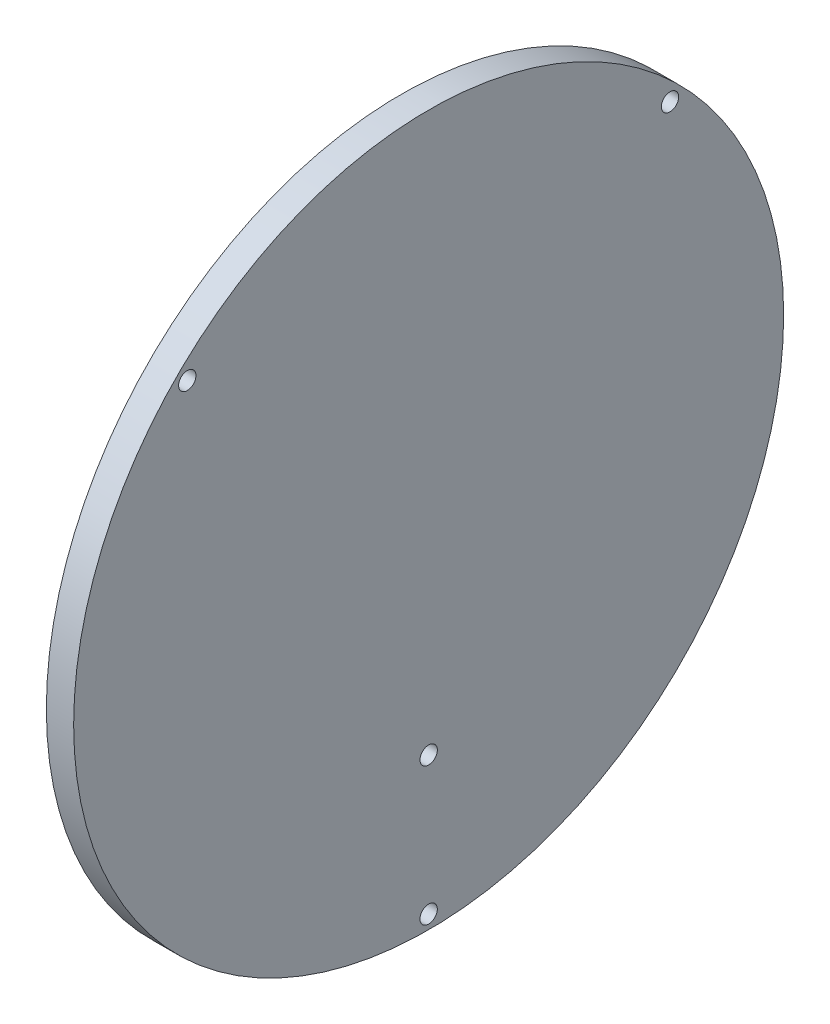
ISO-10303-21;
HEADER;
FILE_DESCRIPTION(('STEP AP214'),'2;1');
FILE_NAME('part.step','',(''),(''),'','','');
FILE_SCHEMA(('AUTOMOTIVE_DESIGN { 1 0 10303 214 1 1 1 1 }'));
ENDSEC;
DATA;
#1=APPLICATION_CONTEXT('core data for automotive mechanical design processes');
#2=APPLICATION_PROTOCOL_DEFINITION('international standard','automotive_design',2000,#1);
#3=PRODUCT_CONTEXT('',#1,'mechanical');
#4=PRODUCT('Part','Part','',(#3));
#5=PRODUCT_RELATED_PRODUCT_CATEGORY('part','',(#4));
#6=PRODUCT_DEFINITION_FORMATION('','',#4);
#7=PRODUCT_DEFINITION_CONTEXT('part definition',#1,'design');
#8=PRODUCT_DEFINITION('design','',#6,#7);
#9=PRODUCT_DEFINITION_SHAPE('','',#8);
#10=(LENGTH_UNIT() NAMED_UNIT(*) SI_UNIT(.MILLI.,.METRE.));
#11=(NAMED_UNIT(*) PLANE_ANGLE_UNIT() SI_UNIT($,.RADIAN.));
#12=(NAMED_UNIT(*) SI_UNIT($,.STERADIAN.) SOLID_ANGLE_UNIT());
#13=UNCERTAINTY_MEASURE_WITH_UNIT(LENGTH_MEASURE(1.E-05),#10,'distance_accuracy_value','');
#14=(GEOMETRIC_REPRESENTATION_CONTEXT(3) GLOBAL_UNCERTAINTY_ASSIGNED_CONTEXT((#13)) GLOBAL_UNIT_ASSIGNED_CONTEXT((#10,
#11,#12)) REPRESENTATION_CONTEXT('',''));
#15=CARTESIAN_POINT('',(0.,0.,0.));
#16=DIRECTION('',(0.,0.,1.));
#17=DIRECTION('',(1.,0.,0.));
#18=AXIS2_PLACEMENT_3D('',#15,#16,#17);
#19=CARTESIAN_POINT('',(20.,0.,0.));
#20=DIRECTION('',(-1.,0.,0.));
#21=DIRECTION('',(0.,0.,1.));
#22=AXIS2_PLACEMENT_3D('',#19,#20,#21);
#23=CYLINDRICAL_SURFACE('',#22,260.);
#24=CARTESIAN_POINT('',(20.,0.,0.));
#25=DIRECTION('',(1.,0.,0.));
#26=DIRECTION('',(0.,0.,-1.));
#27=AXIS2_PLACEMENT_3D('',#24,#25,#26);
#28=CIRCLE('',#27,260.);
#29=CARTESIAN_POINT('',(20.,0.,-260.));
#30=VERTEX_POINT('',#29);
#31=EDGE_CURVE('E10',#30,#30,#28,.T.);
#32=ORIENTED_EDGE('',*,*,#31,.F.);
#33=EDGE_LOOP('',(#32));
#34=FACE_BOUND('',#33,.T.);
#35=CARTESIAN_POINT('',(0.,0.,0.));
#36=DIRECTION('',(1.,0.,0.));
#37=DIRECTION('',(0.,0.,-1.));
#38=AXIS2_PLACEMENT_3D('',#35,#36,#37);
#39=CIRCLE('',#38,260.);
#40=CARTESIAN_POINT('',(0.,0.,-260.));
#41=VERTEX_POINT('',#40);
#42=EDGE_CURVE('E37',#41,#41,#39,.T.);
#43=ORIENTED_EDGE('',*,*,#42,.T.);
#44=EDGE_LOOP('',(#43));
#45=FACE_BOUND('',#44,.T.);
#46=ADVANCED_FACE('F30',(#34,#45),#23,.T.);
#47=CARTESIAN_POINT('',(20.,0.,0.));
#48=DIRECTION('',(1.,0.,0.));
#49=DIRECTION('',(0.,0.,-1.));
#50=AXIS2_PLACEMENT_3D('',#47,#48,#49);
#51=PLANE('',#50);
#52=CARTESIAN_POINT('',(20.,176.776695296637,176.776695296637));
#53=DIRECTION('',(1.,0.,0.));
#54=DIRECTION('',(0.,0.,-1.));
#55=AXIS2_PLACEMENT_3D('',#52,#53,#54);
#56=CIRCLE('',#55,6.34999999999999);
#57=CARTESIAN_POINT('',(20.,176.776695296637,170.426695296637));
#58=VERTEX_POINT('',#57);
#59=EDGE_CURVE('E63',#58,#58,#56,.T.);
#60=ORIENTED_EDGE('',*,*,#59,.F.);
#61=EDGE_LOOP('',(#60));
#62=FACE_BOUND('',#61,.T.);
#63=CARTESIAN_POINT('',(20.,176.776695296636,-176.776695296638));
#64=DIRECTION('',(1.,0.,0.));
#65=DIRECTION('',(0.,0.,-1.));
#66=AXIS2_PLACEMENT_3D('',#63,#64,#65);
#67=CIRCLE('',#66,6.34999999999999);
#68=CARTESIAN_POINT('',(20.,176.776695296636,-183.126695296638));
#69=VERTEX_POINT('',#68);
#70=EDGE_CURVE('E53',#69,#69,#67,.T.);
#71=ORIENTED_EDGE('',*,*,#70,.F.);
#72=EDGE_LOOP('',(#71));
#73=FACE_BOUND('',#72,.T.);
#74=CARTESIAN_POINT('',(20.,-250.,0.));
#75=DIRECTION('',(1.,0.,0.));
#76=DIRECTION('',(0.,0.,-1.));
#77=AXIS2_PLACEMENT_3D('',#74,#75,#76);
#78=CIRCLE('',#77,6.34999999999999);
#79=CARTESIAN_POINT('',(20.,-250.,-6.34999999999999));
#80=VERTEX_POINT('',#79);
#81=EDGE_CURVE('E50',#80,#80,#78,.T.);
#82=ORIENTED_EDGE('',*,*,#81,.F.);
#83=EDGE_LOOP('',(#82));
#84=FACE_BOUND('',#83,.T.);
#85=CARTESIAN_POINT('',(20.,-149.102506576967,0.));
#86=DIRECTION('',(1.,0.,0.));
#87=DIRECTION('',(0.,0.,-1.));
#88=AXIS2_PLACEMENT_3D('',#85,#86,#87);
#89=CIRCLE('',#88,6.34999999999999);
#90=CARTESIAN_POINT('',(20.,-149.102506576967,-6.35000000000005));
#91=VERTEX_POINT('',#90);
#92=EDGE_CURVE('E49',#91,#91,#89,.T.);
#93=ORIENTED_EDGE('',*,*,#92,.F.);
#94=EDGE_LOOP('',(#93));
#95=FACE_BOUND('',#94,.T.);
#96=ORIENTED_EDGE('',*,*,#31,.T.);
#97=EDGE_LOOP('',(#96));
#98=FACE_BOUND('',#97,.T.);
#99=ADVANCED_FACE('F86',(#62,#73,#84,#95,#98),#51,.T.);
#100=CARTESIAN_POINT('',(0.,0.,0.));
#101=DIRECTION('',(1.,0.,0.));
#102=DIRECTION('',(0.,0.,-1.));
#103=AXIS2_PLACEMENT_3D('',#100,#101,#102);
#104=PLANE('',#103);
#105=CARTESIAN_POINT('',(0.,176.776695296637,176.776695296637));
#106=DIRECTION('',(1.,0.,0.));
#107=DIRECTION('',(0.,0.,-1.));
#108=AXIS2_PLACEMENT_3D('',#105,#106,#107);
#109=CIRCLE('',#108,6.34999999999999);
#110=CARTESIAN_POINT('',(0.,176.776695296637,170.426695296637));
#111=VERTEX_POINT('',#110);
#112=EDGE_CURVE('E33',#111,#111,#109,.T.);
#113=ORIENTED_EDGE('',*,*,#112,.T.);
#114=EDGE_LOOP('',(#113));
#115=FACE_BOUND('',#114,.T.);
#116=CARTESIAN_POINT('',(0.,176.776695296636,-176.776695296638));
#117=DIRECTION('',(1.,0.,0.));
#118=DIRECTION('',(0.,0.,-1.));
#119=AXIS2_PLACEMENT_3D('',#116,#117,#118);
#120=CIRCLE('',#119,6.34999999999999);
#121=CARTESIAN_POINT('',(0.,176.776695296636,-183.126695296638));
#122=VERTEX_POINT('',#121);
#123=EDGE_CURVE('E51',#122,#122,#120,.T.);
#124=ORIENTED_EDGE('',*,*,#123,.T.);
#125=EDGE_LOOP('',(#124));
#126=FACE_BOUND('',#125,.T.);
#127=CARTESIAN_POINT('',(0.,-250.,0.));
#128=DIRECTION('',(1.,0.,0.));
#129=DIRECTION('',(0.,0.,-1.));
#130=AXIS2_PLACEMENT_3D('',#127,#128,#129);
#131=CIRCLE('',#130,6.34999999999999);
#132=CARTESIAN_POINT('',(0.,-250.,-6.34999999999999));
#133=VERTEX_POINT('',#132);
#134=EDGE_CURVE('E47',#133,#133,#131,.T.);
#135=ORIENTED_EDGE('',*,*,#134,.T.);
#136=EDGE_LOOP('',(#135));
#137=FACE_BOUND('',#136,.T.);
#138=CARTESIAN_POINT('',(0.,-149.102506576967,0.));
#139=DIRECTION('',(1.,0.,0.));
#140=DIRECTION('',(0.,0.,-1.));
#141=AXIS2_PLACEMENT_3D('',#138,#139,#140);
#142=CIRCLE('',#141,6.34999999999999);
#143=CARTESIAN_POINT('',(0.,-149.102506576967,-6.35000000000005));
#144=VERTEX_POINT('',#143);
#145=EDGE_CURVE('E42',#144,#144,#142,.T.);
#146=ORIENTED_EDGE('',*,*,#145,.T.);
#147=EDGE_LOOP('',(#146));
#148=FACE_BOUND('',#147,.T.);
#149=ORIENTED_EDGE('',*,*,#42,.F.);
#150=EDGE_LOOP('',(#149));
#151=FACE_BOUND('',#150,.T.);
#152=ADVANCED_FACE('F71',(#115,#126,#137,#148,#151),#104,.F.);
#153=CARTESIAN_POINT('',(20.,-149.102506576967,0.));
#154=DIRECTION('',(1.,0.,0.));
#155=DIRECTION('',(0.,0.,-1.));
#156=AXIS2_PLACEMENT_3D('',#153,#154,#155);
#157=CYLINDRICAL_SURFACE('',#156,6.34999999999999);
#158=ORIENTED_EDGE('',*,*,#92,.T.);
#159=EDGE_LOOP('',(#158));
#160=FACE_BOUND('',#159,.T.);
#161=ORIENTED_EDGE('',*,*,#145,.F.);
#162=EDGE_LOOP('',(#161));
#163=FACE_BOUND('',#162,.T.);
#164=ADVANCED_FACE('F74',(#160,#163),#157,.F.);
#165=CARTESIAN_POINT('',(20.,-250.,0.));
#166=DIRECTION('',(1.,0.,0.));
#167=DIRECTION('',(0.,0.,-1.));
#168=AXIS2_PLACEMENT_3D('',#165,#166,#167);
#169=CYLINDRICAL_SURFACE('',#168,6.34999999999999);
#170=ORIENTED_EDGE('',*,*,#81,.T.);
#171=EDGE_LOOP('',(#170));
#172=FACE_BOUND('',#171,.T.);
#173=ORIENTED_EDGE('',*,*,#134,.F.);
#174=EDGE_LOOP('',(#173));
#175=FACE_BOUND('',#174,.T.);
#176=ADVANCED_FACE('F76',(#172,#175),#169,.F.);
#177=CARTESIAN_POINT('',(20.,176.776695296636,-176.776695296638));
#178=DIRECTION('',(1.,0.,0.));
#179=DIRECTION('',(0.,0.,-1.));
#180=AXIS2_PLACEMENT_3D('',#177,#178,#179);
#181=CYLINDRICAL_SURFACE('',#180,6.34999999999999);
#182=ORIENTED_EDGE('',*,*,#70,.T.);
#183=EDGE_LOOP('',(#182));
#184=FACE_BOUND('',#183,.T.);
#185=ORIENTED_EDGE('',*,*,#123,.F.);
#186=EDGE_LOOP('',(#185));
#187=FACE_BOUND('',#186,.T.);
#188=ADVANCED_FACE('F82',(#184,#187),#181,.F.);
#189=CARTESIAN_POINT('',(20.,176.776695296637,176.776695296637));
#190=DIRECTION('',(1.,0.,0.));
#191=DIRECTION('',(0.,0.,-1.));
#192=AXIS2_PLACEMENT_3D('',#189,#190,#191);
#193=CYLINDRICAL_SURFACE('',#192,6.34999999999999);
#194=ORIENTED_EDGE('',*,*,#59,.T.);
#195=EDGE_LOOP('',(#194));
#196=FACE_BOUND('',#195,.T.);
#197=ORIENTED_EDGE('',*,*,#112,.F.);
#198=EDGE_LOOP('',(#197));
#199=FACE_BOUND('',#198,.T.);
#200=ADVANCED_FACE('F109',(#196,#199),#193,.F.);
#201=CLOSED_SHELL('',(#46,#99,#152,#164,#176,#188,#200));
#202=MANIFOLD_SOLID_BREP('B2',#201);
#203=ADVANCED_BREP_SHAPE_REPRESENTATION('',(#18,#202),#14);
#204=SHAPE_DEFINITION_REPRESENTATION(#9,#203);
ENDSEC;
END-ISO-10303-21;
